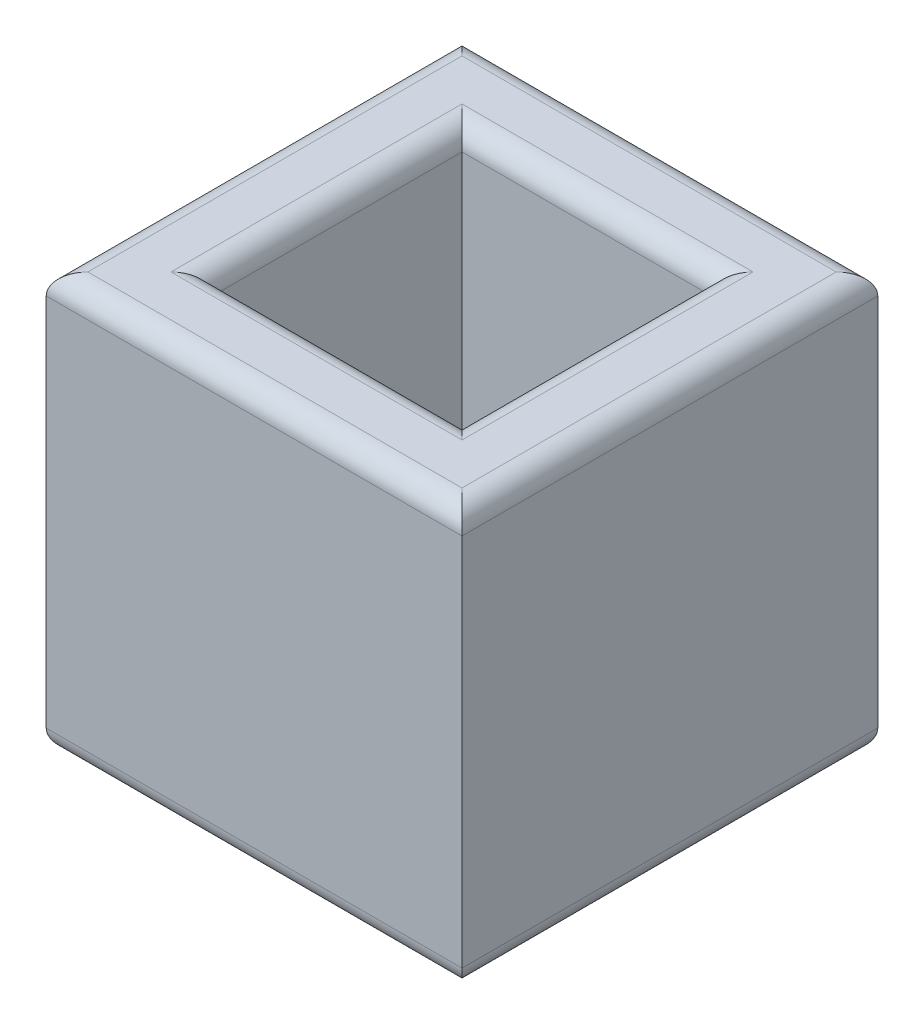
ISO-10303-21;
HEADER;
FILE_DESCRIPTION(('STEP AP214'),'2;1');
FILE_NAME('part.step','',(''),(''),'','','');
FILE_SCHEMA(('AUTOMOTIVE_DESIGN { 1 0 10303 214 1 1 1 1 }'));
ENDSEC;
DATA;
#1=APPLICATION_CONTEXT('core data for automotive mechanical design processes');
#2=APPLICATION_PROTOCOL_DEFINITION('international standard','automotive_design',2000,#1);
#3=PRODUCT_CONTEXT('',#1,'mechanical');
#4=PRODUCT('Part','Part','',(#3));
#5=PRODUCT_RELATED_PRODUCT_CATEGORY('part','',(#4));
#6=PRODUCT_DEFINITION_FORMATION('','',#4);
#7=PRODUCT_DEFINITION_CONTEXT('part definition',#1,'design');
#8=PRODUCT_DEFINITION('design','',#6,#7);
#9=PRODUCT_DEFINITION_SHAPE('','',#8);
#10=(LENGTH_UNIT() NAMED_UNIT(*) SI_UNIT(.MILLI.,.METRE.));
#11=(NAMED_UNIT(*) PLANE_ANGLE_UNIT() SI_UNIT($,.RADIAN.));
#12=(NAMED_UNIT(*) SI_UNIT($,.STERADIAN.) SOLID_ANGLE_UNIT());
#13=UNCERTAINTY_MEASURE_WITH_UNIT(LENGTH_MEASURE(1.E-05),#10,'distance_accuracy_value','');
#14=(GEOMETRIC_REPRESENTATION_CONTEXT(3) GLOBAL_UNCERTAINTY_ASSIGNED_CONTEXT((#13)) GLOBAL_UNIT_ASSIGNED_CONTEXT((#10,
#11,#12)) REPRESENTATION_CONTEXT('',''));
#15=CARTESIAN_POINT('',(0.,0.,0.));
#16=DIRECTION('',(0.,0.,1.));
#17=DIRECTION('',(1.,0.,0.));
#18=AXIS2_PLACEMENT_3D('',#15,#16,#17);
#19=CARTESIAN_POINT('',(-63.5,127.,63.5));
#20=DIRECTION('',(-1.,0.,0.));
#21=DIRECTION('',(0.,0.,1.));
#22=AXIS2_PLACEMENT_3D('',#19,#20,#21);
#23=PLANE('',#22);
#24=DIRECTION('',(0.,-1.,0.));
#25=VECTOR('',#24,1.);
#26=CARTESIAN_POINT('',(-63.5,127.,-63.5));
#27=LINE('',#26,#25);
#28=CARTESIAN_POINT('',(-63.5,120.65,-63.5));
#29=VERTEX_POINT('',#28);
#30=CARTESIAN_POINT('',(-63.5,6.34999999999999,-63.5));
#31=VERTEX_POINT('',#30);
#32=EDGE_CURVE('E311',#29,#31,#27,.T.);
#33=ORIENTED_EDGE('',*,*,#32,.T.);
#34=DIRECTION('',(0.,0.,-1.));
#35=VECTOR('',#34,1.);
#36=CARTESIAN_POINT('',(-63.5,6.34999999999999,63.5));
#37=LINE('',#36,#35);
#38=CARTESIAN_POINT('',(-63.5,6.34999999999999,63.5));
#39=VERTEX_POINT('',#38);
#40=EDGE_CURVE('E280',#31,#39,#37,.F.);
#41=ORIENTED_EDGE('',*,*,#40,.T.);
#42=DIRECTION('',(0.,-1.,0.));
#43=VECTOR('',#42,1.);
#44=CARTESIAN_POINT('',(-63.5,127.,63.5));
#45=LINE('',#44,#43);
#46=CARTESIAN_POINT('',(-63.5,120.65,63.5));
#47=VERTEX_POINT('',#46);
#48=EDGE_CURVE('E170',#47,#39,#45,.T.);
#49=ORIENTED_EDGE('',*,*,#48,.F.);
#50=DIRECTION('',(0.,0.,-1.));
#51=VECTOR('',#50,1.);
#52=CARTESIAN_POINT('',(-63.5,120.65,-63.5));
#53=LINE('',#52,#51);
#54=EDGE_CURVE('E276',#47,#29,#53,.T.);
#55=ORIENTED_EDGE('',*,*,#54,.T.);
#56=EDGE_LOOP('',(#33,#41,#49,#55));
#57=FACE_BOUND('',#56,.T.);
#58=ADVANCED_FACE('F33',(#57),#23,.T.);
#59=CARTESIAN_POINT('',(-63.5,127.,63.5));
#60=DIRECTION('',(0.,0.,-1.));
#61=DIRECTION('',(-1.,0.,0.));
#62=AXIS2_PLACEMENT_3D('',#59,#60,#61);
#63=PLANE('',#62);
#64=ORIENTED_EDGE('',*,*,#48,.T.);
#65=DIRECTION('',(1.,0.,0.));
#66=VECTOR('',#65,1.);
#67=CARTESIAN_POINT('',(63.5,6.34999999999999,63.5));
#68=LINE('',#67,#66);
#69=CARTESIAN_POINT('',(63.5,6.34999999999999,63.5));
#70=VERTEX_POINT('',#69);
#71=EDGE_CURVE('E169',#39,#70,#68,.T.);
#72=ORIENTED_EDGE('',*,*,#71,.T.);
#73=DIRECTION('',(0.,-1.,0.));
#74=VECTOR('',#73,1.);
#75=CARTESIAN_POINT('',(63.5,127.,63.5));
#76=LINE('',#75,#74);
#77=CARTESIAN_POINT('',(63.5,120.65,63.5));
#78=VERTEX_POINT('',#77);
#79=EDGE_CURVE('E150',#78,#70,#76,.T.);
#80=ORIENTED_EDGE('',*,*,#79,.F.);
#81=DIRECTION('',(1.,0.,0.));
#82=VECTOR('',#81,1.);
#83=CARTESIAN_POINT('',(-63.5,120.65,63.5));
#84=LINE('',#83,#82);
#85=EDGE_CURVE('E166',#78,#47,#84,.F.);
#86=ORIENTED_EDGE('',*,*,#85,.T.);
#87=EDGE_LOOP('',(#64,#72,#80,#86));
#88=FACE_BOUND('',#87,.T.);
#89=ADVANCED_FACE('F165',(#88),#63,.F.);
#90=CARTESIAN_POINT('',(63.5,127.,63.5));
#91=DIRECTION('',(-1.,0.,0.));
#92=DIRECTION('',(0.,0.,1.));
#93=AXIS2_PLACEMENT_3D('',#90,#91,#92);
#94=PLANE('',#93);
#95=ORIENTED_EDGE('',*,*,#79,.T.);
#96=DIRECTION('',(0.,0.,-1.));
#97=VECTOR('',#96,1.);
#98=CARTESIAN_POINT('',(63.5,6.34999999999999,-63.5));
#99=LINE('',#98,#97);
#100=CARTESIAN_POINT('',(63.5,6.34999999999999,-63.5));
#101=VERTEX_POINT('',#100);
#102=EDGE_CURVE('E157',#70,#101,#99,.T.);
#103=ORIENTED_EDGE('',*,*,#102,.T.);
#104=DIRECTION('',(0.,-1.,0.));
#105=VECTOR('',#104,1.);
#106=CARTESIAN_POINT('',(63.5,127.,-63.5));
#107=LINE('',#106,#105);
#108=CARTESIAN_POINT('',(63.5,120.65,-63.5));
#109=VERTEX_POINT('',#108);
#110=EDGE_CURVE('E152',#109,#101,#107,.T.);
#111=ORIENTED_EDGE('',*,*,#110,.F.);
#112=DIRECTION('',(0.,0.,-1.));
#113=VECTOR('',#112,1.);
#114=CARTESIAN_POINT('',(63.5,120.65,63.5));
#115=LINE('',#114,#113);
#116=EDGE_CURVE('E147',#109,#78,#115,.F.);
#117=ORIENTED_EDGE('',*,*,#116,.T.);
#118=EDGE_LOOP('',(#95,#103,#111,#117));
#119=FACE_BOUND('',#118,.T.);
#120=ADVANCED_FACE('F149',(#119),#94,.F.);
#121=CARTESIAN_POINT('',(-63.5,127.,-63.5));
#122=DIRECTION('',(0.,0.,-1.));
#123=DIRECTION('',(-1.,0.,0.));
#124=AXIS2_PLACEMENT_3D('',#121,#122,#123);
#125=PLANE('',#124);
#126=ORIENTED_EDGE('',*,*,#110,.T.);
#127=DIRECTION('',(1.,0.,0.));
#128=VECTOR('',#127,1.);
#129=CARTESIAN_POINT('',(-63.5,6.34999999999999,-63.5));
#130=LINE('',#129,#128);
#131=EDGE_CURVE('E281',#101,#31,#130,.F.);
#132=ORIENTED_EDGE('',*,*,#131,.T.);
#133=ORIENTED_EDGE('',*,*,#32,.F.);
#134=DIRECTION('',(1.,0.,0.));
#135=VECTOR('',#134,1.);
#136=CARTESIAN_POINT('',(63.5,120.65,-63.5));
#137=LINE('',#136,#135);
#138=EDGE_CURVE('E285',#29,#109,#137,.T.);
#139=ORIENTED_EDGE('',*,*,#138,.T.);
#140=EDGE_LOOP('',(#126,#132,#133,#139));
#141=FACE_BOUND('',#140,.T.);
#142=ADVANCED_FACE('F331',(#141),#125,.T.);
#143=CARTESIAN_POINT('',(0.,127.,0.));
#144=DIRECTION('',(0.,-1.,0.));
#145=DIRECTION('',(0.,0.,-1.));
#146=AXIS2_PLACEMENT_3D('',#143,#144,#145);
#147=PLANE('',#146);
#148=DIRECTION('',(-1.,0.,0.));
#149=VECTOR('',#148,1.);
#150=CARTESIAN_POINT('',(0.,127.,44.45));
#151=LINE('',#150,#149);
#152=CARTESIAN_POINT('',(44.45,127.,44.45));
#153=VERTEX_POINT('',#152);
#154=CARTESIAN_POINT('',(-44.45,127.,44.45));
#155=VERTEX_POINT('',#154);
#156=EDGE_CURVE('E42',#153,#155,#151,.T.);
#157=ORIENTED_EDGE('',*,*,#156,.T.);
#158=DIRECTION('',(0.,0.,-1.));
#159=VECTOR('',#158,1.);
#160=CARTESIAN_POINT('',(-44.45,127.,0.));
#161=LINE('',#160,#159);
#162=CARTESIAN_POINT('',(-44.45,127.,-44.45));
#163=VERTEX_POINT('',#162);
#164=EDGE_CURVE('E11',#155,#163,#161,.T.);
#165=ORIENTED_EDGE('',*,*,#164,.T.);
#166=DIRECTION('',(1.,0.,0.));
#167=VECTOR('',#166,1.);
#168=CARTESIAN_POINT('',(0.,127.,-44.45));
#169=LINE('',#168,#167);
#170=CARTESIAN_POINT('',(44.45,127.,-44.45));
#171=VERTEX_POINT('',#170);
#172=EDGE_CURVE('E208',#163,#171,#169,.T.);
#173=ORIENTED_EDGE('',*,*,#172,.T.);
#174=DIRECTION('',(0.,0.,1.));
#175=VECTOR('',#174,1.);
#176=CARTESIAN_POINT('',(44.45,127.,0.));
#177=LINE('',#176,#175);
#178=EDGE_CURVE('E53',#171,#153,#177,.T.);
#179=ORIENTED_EDGE('',*,*,#178,.T.);
#180=EDGE_LOOP('',(#157,#165,#173,#179));
#181=FACE_BOUND('',#180,.T.);
#182=DIRECTION('',(0.,0.,-1.));
#183=VECTOR('',#182,1.);
#184=CARTESIAN_POINT('',(-57.15,127.,63.5));
#185=LINE('',#184,#183);
#186=CARTESIAN_POINT('',(-57.15,127.,-57.15));
#187=VERTEX_POINT('',#186);
#188=CARTESIAN_POINT('',(-57.15,127.,57.15));
#189=VERTEX_POINT('',#188);
#190=EDGE_CURVE('E268',#187,#189,#185,.F.);
#191=ORIENTED_EDGE('',*,*,#190,.T.);
#192=DIRECTION('',(1.,0.,0.));
#193=VECTOR('',#192,1.);
#194=CARTESIAN_POINT('',(0.,127.,57.15));
#195=LINE('',#194,#193);
#196=CARTESIAN_POINT('',(57.15,127.,57.15));
#197=VERTEX_POINT('',#196);
#198=EDGE_CURVE('E215',#189,#197,#195,.T.);
#199=ORIENTED_EDGE('',*,*,#198,.T.);
#200=DIRECTION('',(0.,0.,-1.));
#201=VECTOR('',#200,1.);
#202=CARTESIAN_POINT('',(57.15,127.,0.));
#203=LINE('',#202,#201);
#204=CARTESIAN_POINT('',(57.15,127.,-57.15));
#205=VERTEX_POINT('',#204);
#206=EDGE_CURVE('E182',#197,#205,#203,.T.);
#207=ORIENTED_EDGE('',*,*,#206,.T.);
#208=DIRECTION('',(1.,0.,0.));
#209=VECTOR('',#208,1.);
#210=CARTESIAN_POINT('',(-63.5,127.,-57.15));
#211=LINE('',#210,#209);
#212=EDGE_CURVE('E266',#205,#187,#211,.F.);
#213=ORIENTED_EDGE('',*,*,#212,.T.);
#214=EDGE_LOOP('',(#191,#199,#207,#213));
#215=FACE_BOUND('',#214,.T.);
#216=ADVANCED_FACE('F270',(#181,#215),#147,.F.);
#217=CARTESIAN_POINT('',(0.,0.,0.));
#218=DIRECTION('',(0.,-1.,0.));
#219=DIRECTION('',(0.,0.,-1.));
#220=AXIS2_PLACEMENT_3D('',#217,#218,#219);
#221=PLANE('',#220);
#222=DIRECTION('',(0.,0.,-1.));
#223=VECTOR('',#222,1.);
#224=CARTESIAN_POINT('',(57.15,0.,63.5));
#225=LINE('',#224,#223);
#226=CARTESIAN_POINT('',(57.15,0.,-57.15));
#227=VERTEX_POINT('',#226);
#228=CARTESIAN_POINT('',(57.15,0.,57.15));
#229=VERTEX_POINT('',#228);
#230=EDGE_CURVE('E325',#227,#229,#225,.F.);
#231=ORIENTED_EDGE('',*,*,#230,.T.);
#232=DIRECTION('',(1.,0.,0.));
#233=VECTOR('',#232,1.);
#234=CARTESIAN_POINT('',(-63.5,0.,57.15));
#235=LINE('',#234,#233);
#236=CARTESIAN_POINT('',(-57.15,0.,57.15));
#237=VERTEX_POINT('',#236);
#238=EDGE_CURVE('E158',#229,#237,#235,.F.);
#239=ORIENTED_EDGE('',*,*,#238,.T.);
#240=DIRECTION('',(0.,0.,-1.));
#241=VECTOR('',#240,1.);
#242=CARTESIAN_POINT('',(-57.15,0.,0.));
#243=LINE('',#242,#241);
#244=CARTESIAN_POINT('',(-57.15,0.,-57.15));
#245=VERTEX_POINT('',#244);
#246=EDGE_CURVE('E321',#237,#245,#243,.T.);
#247=ORIENTED_EDGE('',*,*,#246,.T.);
#248=DIRECTION('',(1.,0.,0.));
#249=VECTOR('',#248,1.);
#250=CARTESIAN_POINT('',(0.,0.,-57.15));
#251=LINE('',#250,#249);
#252=EDGE_CURVE('E323',#245,#227,#251,.T.);
#253=ORIENTED_EDGE('',*,*,#252,.T.);
#254=EDGE_LOOP('',(#231,#239,#247,#253));
#255=FACE_BOUND('',#254,.T.);
#256=DIRECTION('',(0.,0.,1.));
#257=VECTOR('',#256,1.);
#258=CARTESIAN_POINT('',(-44.45,0.,38.1));
#259=LINE('',#258,#257);
#260=CARTESIAN_POINT('',(-44.45,0.,-44.45));
#261=VERTEX_POINT('',#260);
#262=CARTESIAN_POINT('',(-44.45,0.,44.45));
#263=VERTEX_POINT('',#262);
#264=EDGE_CURVE('E247',#261,#263,#259,.T.);
#265=ORIENTED_EDGE('',*,*,#264,.T.);
#266=DIRECTION('',(1.,0.,0.));
#267=VECTOR('',#266,1.);
#268=CARTESIAN_POINT('',(38.1,0.,44.45));
#269=LINE('',#268,#267);
#270=CARTESIAN_POINT('',(44.45,0.,44.45));
#271=VERTEX_POINT('',#270);
#272=EDGE_CURVE('E318',#263,#271,#269,.T.);
#273=ORIENTED_EDGE('',*,*,#272,.T.);
#274=DIRECTION('',(0.,0.,-1.));
#275=VECTOR('',#274,1.);
#276=CARTESIAN_POINT('',(44.45,0.,-38.1));
#277=LINE('',#276,#275);
#278=CARTESIAN_POINT('',(44.45,0.,-44.45));
#279=VERTEX_POINT('',#278);
#280=EDGE_CURVE('E314',#271,#279,#277,.T.);
#281=ORIENTED_EDGE('',*,*,#280,.T.);
#282=DIRECTION('',(-1.,0.,0.));
#283=VECTOR('',#282,1.);
#284=CARTESIAN_POINT('',(-38.1,0.,-44.45));
#285=LINE('',#284,#283);
#286=EDGE_CURVE('E252',#279,#261,#285,.T.);
#287=ORIENTED_EDGE('',*,*,#286,.T.);
#288=EDGE_LOOP('',(#265,#273,#281,#287));
#289=FACE_BOUND('',#288,.T.);
#290=ADVANCED_FACE('F506',(#255,#289),#221,.T.);
#291=CARTESIAN_POINT('',(38.1,0.,38.1));
#292=DIRECTION('',(1.,0.,0.));
#293=DIRECTION('',(0.,0.,-1.));
#294=AXIS2_PLACEMENT_3D('',#291,#292,#293);
#295=PLANE('',#294);
#296=DIRECTION('',(0.,1.,0.));
#297=VECTOR('',#296,1.);
#298=CARTESIAN_POINT('',(38.1,0.,-38.1));
#299=LINE('',#298,#297);
#300=CARTESIAN_POINT('',(38.1,6.35,-38.1));
#301=VERTEX_POINT('',#300);
#302=CARTESIAN_POINT('',(38.1,120.65,-38.1));
#303=VERTEX_POINT('',#302);
#304=EDGE_CURVE('E229',#301,#303,#299,.T.);
#305=ORIENTED_EDGE('',*,*,#304,.F.);
#306=DIRECTION('',(0.,0.,-1.));
#307=VECTOR('',#306,1.);
#308=CARTESIAN_POINT('',(38.1,6.35,38.1));
#309=LINE('',#308,#307);
#310=CARTESIAN_POINT('',(38.1,6.35,38.1));
#311=VERTEX_POINT('',#310);
#312=EDGE_CURVE('E259',#301,#311,#309,.F.);
#313=ORIENTED_EDGE('',*,*,#312,.T.);
#314=DIRECTION('',(0.,1.,0.));
#315=VECTOR('',#314,1.);
#316=CARTESIAN_POINT('',(38.1,0.,38.1));
#317=LINE('',#316,#315);
#318=CARTESIAN_POINT('',(38.1,120.65,38.1));
#319=VERTEX_POINT('',#318);
#320=EDGE_CURVE('E304',#311,#319,#317,.T.);
#321=ORIENTED_EDGE('',*,*,#320,.T.);
#322=DIRECTION('',(0.,0.,1.));
#323=VECTOR('',#322,1.);
#324=CARTESIAN_POINT('',(38.1,120.65,38.1));
#325=LINE('',#324,#323);
#326=EDGE_CURVE('E212',#319,#303,#325,.F.);
#327=ORIENTED_EDGE('',*,*,#326,.T.);
#328=EDGE_LOOP('',(#305,#313,#321,#327));
#329=FACE_BOUND('',#328,.T.);
#330=ADVANCED_FACE('F497',(#329),#295,.F.);
#331=CARTESIAN_POINT('',(-38.1,0.,38.1));
#332=DIRECTION('',(0.,0.,1.));
#333=DIRECTION('',(1.,0.,0.));
#334=AXIS2_PLACEMENT_3D('',#331,#332,#333);
#335=PLANE('',#334);
#336=ORIENTED_EDGE('',*,*,#320,.F.);
#337=DIRECTION('',(1.,0.,0.));
#338=VECTOR('',#337,1.);
#339=CARTESIAN_POINT('',(-38.1,6.35,38.1));
#340=LINE('',#339,#338);
#341=CARTESIAN_POINT('',(-38.1,6.35,38.1));
#342=VERTEX_POINT('',#341);
#343=EDGE_CURVE('E290',#311,#342,#340,.F.);
#344=ORIENTED_EDGE('',*,*,#343,.T.);
#345=DIRECTION('',(0.,1.,0.));
#346=VECTOR('',#345,1.);
#347=CARTESIAN_POINT('',(-38.1,0.,38.1));
#348=LINE('',#347,#346);
#349=CARTESIAN_POINT('',(-38.1,120.65,38.1));
#350=VERTEX_POINT('',#349);
#351=EDGE_CURVE('E301',#342,#350,#348,.T.);
#352=ORIENTED_EDGE('',*,*,#351,.T.);
#353=DIRECTION('',(-1.,0.,0.));
#354=VECTOR('',#353,1.);
#355=CARTESIAN_POINT('',(-38.1,120.65,38.1));
#356=LINE('',#355,#354);
#357=EDGE_CURVE('E283',#350,#319,#356,.F.);
#358=ORIENTED_EDGE('',*,*,#357,.T.);
#359=EDGE_LOOP('',(#336,#344,#352,#358));
#360=FACE_BOUND('',#359,.T.);
#361=ADVANCED_FACE('F489',(#360),#335,.F.);
#362=CARTESIAN_POINT('',(-38.1,0.,38.1));
#363=DIRECTION('',(-1.,0.,0.));
#364=DIRECTION('',(0.,0.,1.));
#365=AXIS2_PLACEMENT_3D('',#362,#363,#364);
#366=PLANE('',#365);
#367=ORIENTED_EDGE('',*,*,#351,.F.);
#368=DIRECTION('',(0.,0.,1.));
#369=VECTOR('',#368,1.);
#370=CARTESIAN_POINT('',(-38.1,6.35,-38.1));
#371=LINE('',#370,#369);
#372=CARTESIAN_POINT('',(-38.1,6.35,-38.1));
#373=VERTEX_POINT('',#372);
#374=EDGE_CURVE('E245',#342,#373,#371,.F.);
#375=ORIENTED_EDGE('',*,*,#374,.T.);
#376=DIRECTION('',(0.,1.,0.));
#377=VECTOR('',#376,1.);
#378=CARTESIAN_POINT('',(-38.1,0.,-38.1));
#379=LINE('',#378,#377);
#380=CARTESIAN_POINT('',(-38.1,120.65,-38.1));
#381=VERTEX_POINT('',#380);
#382=EDGE_CURVE('E298',#373,#381,#379,.T.);
#383=ORIENTED_EDGE('',*,*,#382,.T.);
#384=DIRECTION('',(0.,0.,-1.));
#385=VECTOR('',#384,1.);
#386=CARTESIAN_POINT('',(-38.1,120.65,38.1));
#387=LINE('',#386,#385);
#388=EDGE_CURVE('E292',#381,#350,#387,.F.);
#389=ORIENTED_EDGE('',*,*,#388,.T.);
#390=EDGE_LOOP('',(#367,#375,#383,#389));
#391=FACE_BOUND('',#390,.T.);
#392=ADVANCED_FACE('F297',(#391),#366,.F.);
#393=CARTESIAN_POINT('',(-38.1,0.,-38.1));
#394=DIRECTION('',(0.,0.,-1.));
#395=DIRECTION('',(-1.,0.,0.));
#396=AXIS2_PLACEMENT_3D('',#393,#394,#395);
#397=PLANE('',#396);
#398=ORIENTED_EDGE('',*,*,#382,.F.);
#399=DIRECTION('',(-1.,0.,0.));
#400=VECTOR('',#399,1.);
#401=CARTESIAN_POINT('',(38.1,6.35,-38.1));
#402=LINE('',#401,#400);
#403=EDGE_CURVE('E253',#373,#301,#402,.F.);
#404=ORIENTED_EDGE('',*,*,#403,.T.);
#405=ORIENTED_EDGE('',*,*,#304,.T.);
#406=DIRECTION('',(1.,0.,0.));
#407=VECTOR('',#406,1.);
#408=CARTESIAN_POINT('',(-38.1,120.65,-38.1));
#409=LINE('',#408,#407);
#410=EDGE_CURVE('E209',#303,#381,#409,.F.);
#411=ORIENTED_EDGE('',*,*,#410,.T.);
#412=EDGE_LOOP('',(#398,#404,#405,#411));
#413=FACE_BOUND('',#412,.T.);
#414=ADVANCED_FACE('F302',(#413),#397,.F.);
#415=CARTESIAN_POINT('',(0.,6.35,-57.15));
#416=DIRECTION('',(1.,0.,0.));
#417=DIRECTION('',(0.,0.,-1.));
#418=AXIS2_PLACEMENT_3D('',#415,#416,#417);
#419=CYLINDRICAL_SURFACE('',#418,6.35);
#420=CARTESIAN_POINT('',(57.15,6.35,-57.15));
#421=DIRECTION('',(0.707106781186547,0.,0.707106781186547));
#422=DIRECTION('',(0.707106781186547,0.,-0.707106781186547));
#423=AXIS2_PLACEMENT_3D('',#420,#421,#422);
#424=ELLIPSE('',#423,8.98025612106915,6.35);
#425=EDGE_CURVE('E223',#227,#101,#424,.T.);
#426=ORIENTED_EDGE('',*,*,#425,.F.);
#427=ORIENTED_EDGE('',*,*,#252,.F.);
#428=CARTESIAN_POINT('',(-57.15,6.35,-57.15));
#429=DIRECTION('',(0.707106781186547,0.,-0.707106781186547));
#430=DIRECTION('',(-0.707106781186547,0.,-0.707106781186547));
#431=AXIS2_PLACEMENT_3D('',#428,#429,#430);
#432=ELLIPSE('',#431,8.98025612106915,6.35);
#433=EDGE_CURVE('E226',#31,#245,#432,.F.);
#434=ORIENTED_EDGE('',*,*,#433,.F.);
#435=ORIENTED_EDGE('',*,*,#131,.F.);
#436=EDGE_LOOP('',(#426,#427,#434,#435));
#437=FACE_BOUND('',#436,.T.);
#438=ADVANCED_FACE('F367',(#437),#419,.T.);
#439=CARTESIAN_POINT('',(-57.15,6.35,0.));
#440=DIRECTION('',(0.,0.,-1.));
#441=DIRECTION('',(-1.,0.,0.));
#442=AXIS2_PLACEMENT_3D('',#439,#440,#441);
#443=CYLINDRICAL_SURFACE('',#442,6.35);
#444=ORIENTED_EDGE('',*,*,#433,.T.);
#445=ORIENTED_EDGE('',*,*,#246,.F.);
#446=CARTESIAN_POINT('',(-57.15,6.35,57.15));
#447=DIRECTION('',(-0.707106781186547,0.,-0.707106781186547));
#448=DIRECTION('',(0.707106781186547,0.,-0.707106781186547));
#449=AXIS2_PLACEMENT_3D('',#446,#447,#448);
#450=ELLIPSE('',#449,8.98025612106915,6.35);
#451=EDGE_CURVE('E221',#39,#237,#450,.F.);
#452=ORIENTED_EDGE('',*,*,#451,.F.);
#453=ORIENTED_EDGE('',*,*,#40,.F.);
#454=EDGE_LOOP('',(#444,#445,#452,#453));
#455=FACE_BOUND('',#454,.T.);
#456=ADVANCED_FACE('F363',(#455),#443,.T.);
#457=CARTESIAN_POINT('',(57.15,6.34999999999999,63.5));
#458=DIRECTION('',(0.,0.,1.));
#459=DIRECTION('',(1.,0.,0.));
#460=AXIS2_PLACEMENT_3D('',#457,#458,#459);
#461=CYLINDRICAL_SURFACE('',#460,6.35);
#462=ORIENTED_EDGE('',*,*,#425,.T.);
#463=ORIENTED_EDGE('',*,*,#102,.F.);
#464=CARTESIAN_POINT('',(57.15,6.34999999999999,57.15));
#465=DIRECTION('',(-0.707106781186547,0.,0.707106781186547));
#466=DIRECTION('',(0.707106781186547,0.,0.707106781186547));
#467=AXIS2_PLACEMENT_3D('',#464,#465,#466);
#468=ELLIPSE('',#467,8.98025612106915,6.35);
#469=EDGE_CURVE('E219',#229,#70,#468,.T.);
#470=ORIENTED_EDGE('',*,*,#469,.F.);
#471=ORIENTED_EDGE('',*,*,#230,.F.);
#472=EDGE_LOOP('',(#462,#463,#470,#471));
#473=FACE_BOUND('',#472,.T.);
#474=ADVANCED_FACE('F359',(#473),#461,.T.);
#475=CARTESIAN_POINT('',(-63.5,6.34999999999999,57.15));
#476=DIRECTION('',(-1.,0.,0.));
#477=DIRECTION('',(0.,0.,1.));
#478=AXIS2_PLACEMENT_3D('',#475,#476,#477);
#479=CYLINDRICAL_SURFACE('',#478,6.35);
#480=ORIENTED_EDGE('',*,*,#451,.T.);
#481=ORIENTED_EDGE('',*,*,#238,.F.);
#482=ORIENTED_EDGE('',*,*,#469,.T.);
#483=ORIENTED_EDGE('',*,*,#71,.F.);
#484=EDGE_LOOP('',(#480,#481,#482,#483));
#485=FACE_BOUND('',#484,.T.);
#486=ADVANCED_FACE('F356',(#485),#479,.T.);
#487=CARTESIAN_POINT('',(0.,6.35,-44.45));
#488=DIRECTION('',(1.,0.,0.));
#489=DIRECTION('',(0.,0.,-1.));
#490=AXIS2_PLACEMENT_3D('',#487,#488,#489);
#491=CYLINDRICAL_SURFACE('',#490,6.35);
#492=CARTESIAN_POINT('',(44.45,6.35,-44.45));
#493=DIRECTION('',(0.707106781186547,0.,0.707106781186547));
#494=DIRECTION('',(0.707106781186547,0.,-0.707106781186547));
#495=AXIS2_PLACEMENT_3D('',#492,#493,#494);
#496=ELLIPSE('',#495,8.98025612106915,6.35);
#497=EDGE_CURVE('E232',#301,#279,#496,.T.);
#498=ORIENTED_EDGE('',*,*,#497,.F.);
#499=ORIENTED_EDGE('',*,*,#403,.F.);
#500=CARTESIAN_POINT('',(-44.45,6.35,-44.45));
#501=DIRECTION('',(0.707106781186547,0.,-0.707106781186547));
#502=DIRECTION('',(-0.707106781186547,0.,-0.707106781186547));
#503=AXIS2_PLACEMENT_3D('',#500,#501,#502);
#504=ELLIPSE('',#503,8.98025612106915,6.35);
#505=EDGE_CURVE('E190',#261,#373,#504,.F.);
#506=ORIENTED_EDGE('',*,*,#505,.F.);
#507=ORIENTED_EDGE('',*,*,#286,.F.);
#508=EDGE_LOOP('',(#498,#499,#506,#507));
#509=FACE_BOUND('',#508,.T.);
#510=ADVANCED_FACE('F251',(#509),#491,.T.);
#511=CARTESIAN_POINT('',(-44.45,6.35,0.));
#512=DIRECTION('',(0.,0.,-1.));
#513=DIRECTION('',(-1.,0.,0.));
#514=AXIS2_PLACEMENT_3D('',#511,#512,#513);
#515=CYLINDRICAL_SURFACE('',#514,6.35);
#516=ORIENTED_EDGE('',*,*,#505,.T.);
#517=ORIENTED_EDGE('',*,*,#374,.F.);
#518=CARTESIAN_POINT('',(-44.45,6.35,44.45));
#519=DIRECTION('',(-0.707106781186547,0.,-0.707106781186547));
#520=DIRECTION('',(-0.707106781186547,0.,0.707106781186547));
#521=AXIS2_PLACEMENT_3D('',#518,#519,#520);
#522=ELLIPSE('',#521,8.98025612106915,6.35);
#523=EDGE_CURVE('E231',#263,#342,#522,.F.);
#524=ORIENTED_EDGE('',*,*,#523,.F.);
#525=ORIENTED_EDGE('',*,*,#264,.F.);
#526=EDGE_LOOP('',(#516,#517,#524,#525));
#527=FACE_BOUND('',#526,.T.);
#528=ADVANCED_FACE('F243',(#527),#515,.T.);
#529=CARTESIAN_POINT('',(44.45,6.35,0.));
#530=DIRECTION('',(0.,0.,1.));
#531=DIRECTION('',(1.,0.,0.));
#532=AXIS2_PLACEMENT_3D('',#529,#530,#531);
#533=CYLINDRICAL_SURFACE('',#532,6.35);
#534=ORIENTED_EDGE('',*,*,#497,.T.);
#535=ORIENTED_EDGE('',*,*,#280,.F.);
#536=CARTESIAN_POINT('',(44.45,6.35,44.45));
#537=DIRECTION('',(-0.707106781186547,0.,0.707106781186547));
#538=DIRECTION('',(-0.707106781186547,0.,-0.707106781186547));
#539=AXIS2_PLACEMENT_3D('',#536,#537,#538);
#540=ELLIPSE('',#539,8.98025612106915,6.35);
#541=EDGE_CURVE('E197',#311,#271,#540,.T.);
#542=ORIENTED_EDGE('',*,*,#541,.F.);
#543=ORIENTED_EDGE('',*,*,#312,.F.);
#544=EDGE_LOOP('',(#534,#535,#542,#543));
#545=FACE_BOUND('',#544,.T.);
#546=ADVANCED_FACE('F343',(#545),#533,.T.);
#547=CARTESIAN_POINT('',(0.,6.35,44.45));
#548=DIRECTION('',(-1.,0.,0.));
#549=DIRECTION('',(0.,0.,1.));
#550=AXIS2_PLACEMENT_3D('',#547,#548,#549);
#551=CYLINDRICAL_SURFACE('',#550,6.35);
#552=ORIENTED_EDGE('',*,*,#523,.T.);
#553=ORIENTED_EDGE('',*,*,#343,.F.);
#554=ORIENTED_EDGE('',*,*,#541,.T.);
#555=ORIENTED_EDGE('',*,*,#272,.F.);
#556=EDGE_LOOP('',(#552,#553,#554,#555));
#557=FACE_BOUND('',#556,.T.);
#558=ADVANCED_FACE('F336',(#557),#551,.T.);
#559=CARTESIAN_POINT('',(-63.5,120.65,-57.15));
#560=DIRECTION('',(-1.,0.,0.));
#561=DIRECTION('',(0.,0.,1.));
#562=AXIS2_PLACEMENT_3D('',#559,#560,#561);
#563=CYLINDRICAL_SURFACE('',#562,6.35);
#564=CARTESIAN_POINT('',(57.15,120.65,-57.15));
#565=DIRECTION('',(-0.707106781186547,0.,-0.707106781186547));
#566=DIRECTION('',(0.707106781186547,0.,-0.707106781186547));
#567=AXIS2_PLACEMENT_3D('',#564,#565,#566);
#568=ELLIPSE('',#567,8.98025612106915,6.35);
#569=EDGE_CURVE('E185',#109,#205,#568,.F.);
#570=ORIENTED_EDGE('',*,*,#569,.F.);
#571=ORIENTED_EDGE('',*,*,#138,.F.);
#572=CARTESIAN_POINT('',(-57.15,120.65,-57.15));
#573=DIRECTION('',(-0.707106781186547,0.,0.707106781186547));
#574=DIRECTION('',(-0.707106781186547,0.,-0.707106781186547));
#575=AXIS2_PLACEMENT_3D('',#572,#573,#574);
#576=ELLIPSE('',#575,8.98025612106915,6.35);
#577=EDGE_CURVE('E194',#187,#29,#576,.T.);
#578=ORIENTED_EDGE('',*,*,#577,.F.);
#579=ORIENTED_EDGE('',*,*,#212,.F.);
#580=EDGE_LOOP('',(#570,#571,#578,#579));
#581=FACE_BOUND('',#580,.T.);
#582=ADVANCED_FACE('F334',(#581),#563,.T.);
#583=CARTESIAN_POINT('',(-57.15,120.65,63.5));
#584=DIRECTION('',(0.,0.,1.));
#585=DIRECTION('',(1.,0.,0.));
#586=AXIS2_PLACEMENT_3D('',#583,#584,#585);
#587=CYLINDRICAL_SURFACE('',#586,6.35);
#588=ORIENTED_EDGE('',*,*,#577,.T.);
#589=ORIENTED_EDGE('',*,*,#54,.F.);
#590=CARTESIAN_POINT('',(-57.15,120.65,57.15));
#591=DIRECTION('',(0.707106781186547,0.,0.707106781186547));
#592=DIRECTION('',(-0.707106781186547,0.,0.707106781186547));
#593=AXIS2_PLACEMENT_3D('',#590,#591,#592);
#594=ELLIPSE('',#593,8.98025612106915,6.35);
#595=EDGE_CURVE('E178',#189,#47,#594,.T.);
#596=ORIENTED_EDGE('',*,*,#595,.F.);
#597=ORIENTED_EDGE('',*,*,#190,.F.);
#598=EDGE_LOOP('',(#588,#589,#596,#597));
#599=FACE_BOUND('',#598,.T.);
#600=ADVANCED_FACE('F275',(#599),#587,.T.);
#601=CARTESIAN_POINT('',(57.15,120.65,0.));
#602=DIRECTION('',(0.,0.,-1.));
#603=DIRECTION('',(-1.,0.,0.));
#604=AXIS2_PLACEMENT_3D('',#601,#602,#603);
#605=CYLINDRICAL_SURFACE('',#604,6.35);
#606=ORIENTED_EDGE('',*,*,#569,.T.);
#607=ORIENTED_EDGE('',*,*,#206,.F.);
#608=CARTESIAN_POINT('',(57.15,120.65,57.15));
#609=DIRECTION('',(0.707106781186547,0.,-0.707106781186547));
#610=DIRECTION('',(-0.707106781186547,0.,-0.707106781186547));
#611=AXIS2_PLACEMENT_3D('',#608,#609,#610);
#612=ELLIPSE('',#611,8.98025612106915,6.35);
#613=EDGE_CURVE('E175',#78,#197,#612,.F.);
#614=ORIENTED_EDGE('',*,*,#613,.F.);
#615=ORIENTED_EDGE('',*,*,#116,.F.);
#616=EDGE_LOOP('',(#606,#607,#614,#615));
#617=FACE_BOUND('',#616,.T.);
#618=ADVANCED_FACE('F181',(#617),#605,.T.);
#619=CARTESIAN_POINT('',(0.,120.65,57.15));
#620=DIRECTION('',(1.,0.,0.));
#621=DIRECTION('',(0.,0.,-1.));
#622=AXIS2_PLACEMENT_3D('',#619,#620,#621);
#623=CYLINDRICAL_SURFACE('',#622,6.35);
#624=ORIENTED_EDGE('',*,*,#595,.T.);
#625=ORIENTED_EDGE('',*,*,#85,.F.);
#626=ORIENTED_EDGE('',*,*,#613,.T.);
#627=ORIENTED_EDGE('',*,*,#198,.F.);
#628=EDGE_LOOP('',(#624,#625,#626,#627));
#629=FACE_BOUND('',#628,.T.);
#630=ADVANCED_FACE('F173',(#629),#623,.T.);
#631=CARTESIAN_POINT('',(44.45,120.65,0.));
#632=DIRECTION('',(0.,0.,1.));
#633=DIRECTION('',(1.,0.,0.));
#634=AXIS2_PLACEMENT_3D('',#631,#632,#633);
#635=CYLINDRICAL_SURFACE('',#634,6.35);
#636=CARTESIAN_POINT('',(44.45,120.65,-44.45));
#637=DIRECTION('',(0.707106781186547,0.,0.707106781186547));
#638=DIRECTION('',(-0.707106781186547,0.,0.707106781186547));
#639=AXIS2_PLACEMENT_3D('',#636,#637,#638);
#640=ELLIPSE('',#639,8.98025612106915,6.35);
#641=EDGE_CURVE('E188',#303,#171,#640,.F.);
#642=ORIENTED_EDGE('',*,*,#641,.F.);
#643=ORIENTED_EDGE('',*,*,#326,.F.);
#644=CARTESIAN_POINT('',(44.45,120.65,44.45));
#645=DIRECTION('',(-0.707106781186547,0.,0.707106781186547));
#646=DIRECTION('',(-0.707106781186547,0.,-0.707106781186547));
#647=AXIS2_PLACEMENT_3D('',#644,#645,#646);
#648=ELLIPSE('',#647,8.98025612106915,6.35);
#649=EDGE_CURVE('E37',#153,#319,#648,.T.);
#650=ORIENTED_EDGE('',*,*,#649,.F.);
#651=ORIENTED_EDGE('',*,*,#178,.F.);
#652=EDGE_LOOP('',(#642,#643,#650,#651));
#653=FACE_BOUND('',#652,.T.);
#654=ADVANCED_FACE('F35',(#653),#635,.T.);
#655=CARTESIAN_POINT('',(0.,120.65,44.45));
#656=DIRECTION('',(-1.,0.,0.));
#657=DIRECTION('',(0.,0.,1.));
#658=AXIS2_PLACEMENT_3D('',#655,#656,#657);
#659=CYLINDRICAL_SURFACE('',#658,6.35);
#660=ORIENTED_EDGE('',*,*,#649,.T.);
#661=ORIENTED_EDGE('',*,*,#357,.F.);
#662=CARTESIAN_POINT('',(-44.45,120.65,44.45));
#663=DIRECTION('',(-0.707106781186547,0.,-0.707106781186547));
#664=DIRECTION('',(0.707106781186547,0.,-0.707106781186547));
#665=AXIS2_PLACEMENT_3D('',#662,#663,#664);
#666=ELLIPSE('',#665,8.98025612106915,6.35);
#667=EDGE_CURVE('E200',#155,#350,#666,.T.);
#668=ORIENTED_EDGE('',*,*,#667,.F.);
#669=ORIENTED_EDGE('',*,*,#156,.F.);
#670=EDGE_LOOP('',(#660,#661,#668,#669));
#671=FACE_BOUND('',#670,.T.);
#672=ADVANCED_FACE('F395',(#671),#659,.T.);
#673=CARTESIAN_POINT('',(0.,120.65,-44.45));
#674=DIRECTION('',(1.,0.,0.));
#675=DIRECTION('',(0.,0.,-1.));
#676=AXIS2_PLACEMENT_3D('',#673,#674,#675);
#677=CYLINDRICAL_SURFACE('',#676,6.35);
#678=ORIENTED_EDGE('',*,*,#641,.T.);
#679=ORIENTED_EDGE('',*,*,#172,.F.);
#680=CARTESIAN_POINT('',(-44.45,120.65,-44.45));
#681=DIRECTION('',(0.707106781186547,0.,-0.707106781186547));
#682=DIRECTION('',(-0.707106781186547,0.,-0.707106781186547));
#683=AXIS2_PLACEMENT_3D('',#680,#681,#682);
#684=ELLIPSE('',#683,8.98025612106915,6.35);
#685=EDGE_CURVE('E198',#381,#163,#684,.F.);
#686=ORIENTED_EDGE('',*,*,#685,.F.);
#687=ORIENTED_EDGE('',*,*,#410,.F.);
#688=EDGE_LOOP('',(#678,#679,#686,#687));
#689=FACE_BOUND('',#688,.T.);
#690=ADVANCED_FACE('F206',(#689),#677,.T.);
#691=CARTESIAN_POINT('',(-44.45,120.65,0.));
#692=DIRECTION('',(0.,0.,-1.));
#693=DIRECTION('',(-1.,0.,0.));
#694=AXIS2_PLACEMENT_3D('',#691,#692,#693);
#695=CYLINDRICAL_SURFACE('',#694,6.35);
#696=ORIENTED_EDGE('',*,*,#667,.T.);
#697=ORIENTED_EDGE('',*,*,#388,.F.);
#698=ORIENTED_EDGE('',*,*,#685,.T.);
#699=ORIENTED_EDGE('',*,*,#164,.F.);
#700=EDGE_LOOP('',(#696,#697,#698,#699));
#701=FACE_BOUND('',#700,.T.);
#702=ADVANCED_FACE('F407',(#701),#695,.T.);
#703=CLOSED_SHELL('',(#58,#89,#120,#142,#216,#290,#330,#361,#392,#414,#438,#456,#474,#486,#510,
#528,#546,#558,#582,#600,#618,#630,#654,#672,#690,#702));
#704=MANIFOLD_SOLID_BREP('B2',#703);
#705=ADVANCED_BREP_SHAPE_REPRESENTATION('',(#18,#704),#14);
#706=SHAPE_DEFINITION_REPRESENTATION(#9,#705);
ENDSEC;
END-ISO-10303-21;
